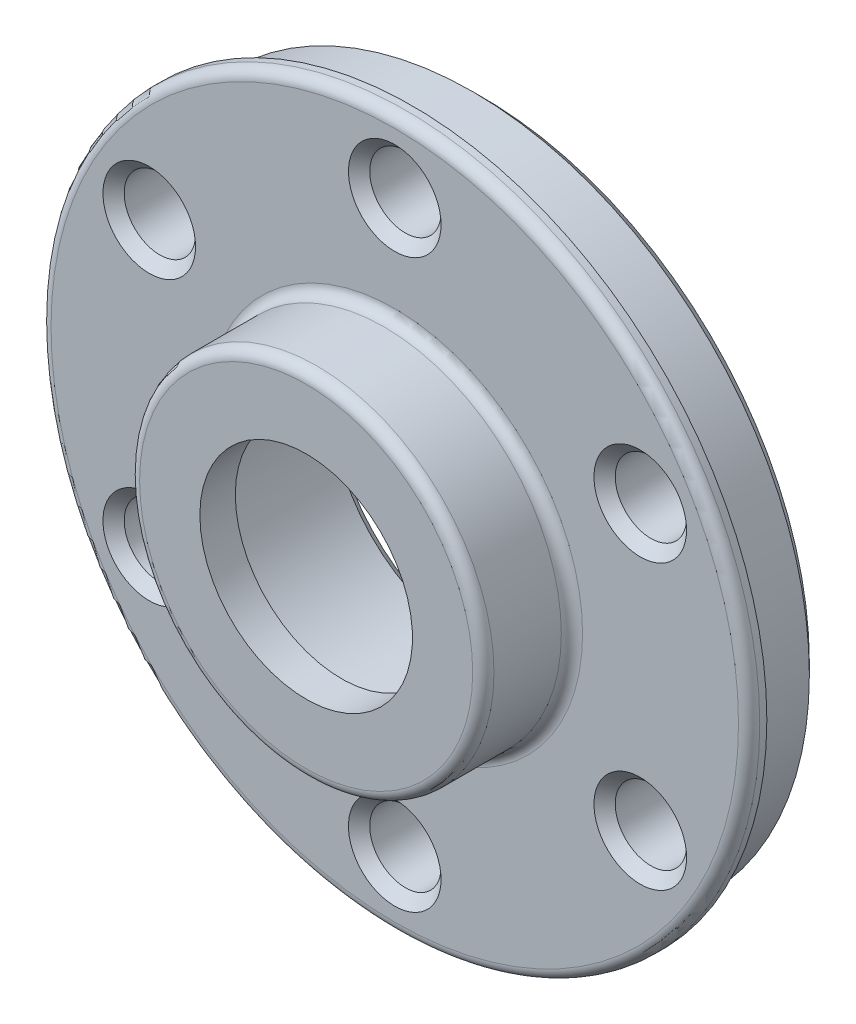
ISO-10303-21;
HEADER;
FILE_DESCRIPTION(('STEP AP214'),'2;1');
FILE_NAME('part.step','',(''),(''),'','','');
FILE_SCHEMA(('AUTOMOTIVE_DESIGN { 1 0 10303 214 1 1 1 1 }'));
ENDSEC;
DATA;
#1=APPLICATION_CONTEXT('core data for automotive mechanical design processes');
#2=APPLICATION_PROTOCOL_DEFINITION('international standard','automotive_design',2000,#1);
#3=PRODUCT_CONTEXT('',#1,'mechanical');
#4=PRODUCT('Part','Part','',(#3));
#5=PRODUCT_RELATED_PRODUCT_CATEGORY('part','',(#4));
#6=PRODUCT_DEFINITION_FORMATION('','',#4);
#7=PRODUCT_DEFINITION_CONTEXT('part definition',#1,'design');
#8=PRODUCT_DEFINITION('design','',#6,#7);
#9=PRODUCT_DEFINITION_SHAPE('','',#8);
#10=(LENGTH_UNIT() NAMED_UNIT(*) SI_UNIT(.MILLI.,.METRE.));
#11=(NAMED_UNIT(*) PLANE_ANGLE_UNIT() SI_UNIT($,.RADIAN.));
#12=(NAMED_UNIT(*) SI_UNIT($,.STERADIAN.) SOLID_ANGLE_UNIT());
#13=UNCERTAINTY_MEASURE_WITH_UNIT(LENGTH_MEASURE(1.E-05),#10,'distance_accuracy_value','');
#14=(GEOMETRIC_REPRESENTATION_CONTEXT(3) GLOBAL_UNCERTAINTY_ASSIGNED_CONTEXT((#13)) GLOBAL_UNIT_ASSIGNED_CONTEXT((#10,
#11,#12)) REPRESENTATION_CONTEXT('',''));
#15=CARTESIAN_POINT('',(0.,0.,0.));
#16=DIRECTION('',(0.,0.,1.));
#17=DIRECTION('',(1.,0.,0.));
#18=AXIS2_PLACEMENT_3D('',#15,#16,#17);
#19=CARTESIAN_POINT('',(0.,0.,2.7));
#20=DIRECTION('',(0.,0.,1.));
#21=DIRECTION('',(1.,0.,0.));
#22=AXIS2_PLACEMENT_3D('',#19,#20,#21);
#23=TOROIDAL_SURFACE('',#22,4.7,0.3);
#24=CARTESIAN_POINT('',(0.,0.,3.));
#25=DIRECTION('',(0.,0.,-1.));
#26=DIRECTION('',(1.,0.,0.));
#27=AXIS2_PLACEMENT_3D('',#24,#25,#26);
#28=CIRCLE('',#27,4.7);
#29=CARTESIAN_POINT('',(4.7,0.,3.));
#30=VERTEX_POINT('',#29);
#31=EDGE_CURVE('E97',#30,#30,#28,.F.);
#32=ORIENTED_EDGE('',*,*,#31,.F.);
#33=EDGE_LOOP('',(#32));
#34=FACE_BOUND('',#33,.T.);
#35=CARTESIAN_POINT('',(0.,0.,2.7));
#36=DIRECTION('',(0.,0.,1.));
#37=DIRECTION('',(1.,0.,0.));
#38=AXIS2_PLACEMENT_3D('',#35,#36,#37);
#39=CIRCLE('',#38,5.);
#40=CARTESIAN_POINT('',(5.,0.,2.7));
#41=VERTEX_POINT('',#40);
#42=EDGE_CURVE('E152',#41,#41,#39,.F.);
#43=ORIENTED_EDGE('',*,*,#42,.F.);
#44=EDGE_LOOP('',(#43));
#45=FACE_BOUND('',#44,.T.);
#46=ADVANCED_FACE('F14',(#34,#45),#23,.T.);
#47=CARTESIAN_POINT('',(0.,0.,0.5));
#48=DIRECTION('',(0.,0.,1.));
#49=DIRECTION('',(1.,0.,0.));
#50=AXIS2_PLACEMENT_3D('',#47,#48,#49);
#51=CYLINDRICAL_SURFACE('',#50,5.);
#52=CARTESIAN_POINT('',(0.,0.,0.8));
#53=DIRECTION('',(0.,0.,-1.));
#54=DIRECTION('',(-1.,0.,0.));
#55=AXIS2_PLACEMENT_3D('',#52,#53,#54);
#56=CIRCLE('',#55,5.);
#57=CARTESIAN_POINT('',(-5.,0.,0.8));
#58=VERTEX_POINT('',#57);
#59=EDGE_CURVE('E88',#58,#58,#56,.F.);
#60=ORIENTED_EDGE('',*,*,#59,.T.);
#61=EDGE_LOOP('',(#60));
#62=FACE_BOUND('',#61,.T.);
#63=ORIENTED_EDGE('',*,*,#42,.T.);
#64=EDGE_LOOP('',(#63));
#65=FACE_BOUND('',#64,.T.);
#66=ADVANCED_FACE('F162',(#62,#65),#51,.T.);
#67=CARTESIAN_POINT('',(0.,0.,3.));
#68=DIRECTION('',(0.,0.,1.));
#69=DIRECTION('',(1.,0.,0.));
#70=AXIS2_PLACEMENT_3D('',#67,#68,#69);
#71=PLANE('',#70);
#72=CARTESIAN_POINT('',(0.,0.,3.));
#73=DIRECTION('',(0.,0.,-1.));
#74=DIRECTION('',(-1.,0.,0.));
#75=AXIS2_PLACEMENT_3D('',#72,#73,#74);
#76=CIRCLE('',#75,3.);
#77=CARTESIAN_POINT('',(-3.,0.,3.));
#78=VERTEX_POINT('',#77);
#79=EDGE_CURVE('E19',#78,#78,#76,.T.);
#80=ORIENTED_EDGE('',*,*,#79,.T.);
#81=EDGE_LOOP('',(#80));
#82=FACE_BOUND('',#81,.T.);
#83=ORIENTED_EDGE('',*,*,#31,.T.);
#84=EDGE_LOOP('',(#83));
#85=FACE_BOUND('',#84,.T.);
#86=ADVANCED_FACE('F154',(#82,#85),#71,.T.);
#87=CARTESIAN_POINT('',(0.,0.,0.));
#88=DIRECTION('',(0.,0.,1.));
#89=DIRECTION('',(1.,0.,0.));
#90=AXIS2_PLACEMENT_3D('',#87,#88,#89);
#91=CYLINDRICAL_SURFACE('',#90,10.);
#92=CARTESIAN_POINT('',(0.,0.,0.2));
#93=DIRECTION('',(0.,0.,1.));
#94=DIRECTION('',(1.,0.,0.));
#95=AXIS2_PLACEMENT_3D('',#92,#93,#94);
#96=CIRCLE('',#95,10.);
#97=CARTESIAN_POINT('',(10.,0.,0.2));
#98=VERTEX_POINT('',#97);
#99=EDGE_CURVE('E92',#98,#98,#96,.T.);
#100=ORIENTED_EDGE('',*,*,#99,.F.);
#101=EDGE_LOOP('',(#100));
#102=FACE_BOUND('',#101,.T.);
#103=CARTESIAN_POINT('',(0.,0.,0.));
#104=DIRECTION('',(0.,0.,1.));
#105=DIRECTION('',(1.,0.,0.));
#106=AXIS2_PLACEMENT_3D('',#103,#104,#105);
#107=CIRCLE('',#106,10.);
#108=CARTESIAN_POINT('',(10.,0.,0.));
#109=VERTEX_POINT('',#108);
#110=EDGE_CURVE('E81',#109,#109,#107,.T.);
#111=ORIENTED_EDGE('',*,*,#110,.T.);
#112=EDGE_LOOP('',(#111));
#113=FACE_BOUND('',#112,.T.);
#114=ADVANCED_FACE('F130',(#102,#113),#91,.T.);
#115=CARTESIAN_POINT('',(0.,0.,0.2));
#116=DIRECTION('',(0.,0.,1.));
#117=DIRECTION('',(1.,0.,0.));
#118=AXIS2_PLACEMENT_3D('',#115,#116,#117);
#119=TOROIDAL_SURFACE('',#118,9.7,0.3);
#120=CARTESIAN_POINT('',(0.,0.,0.5));
#121=DIRECTION('',(0.,0.,-1.));
#122=DIRECTION('',(1.,0.,0.));
#123=AXIS2_PLACEMENT_3D('',#120,#121,#122);
#124=CIRCLE('',#123,9.7);
#125=CARTESIAN_POINT('',(9.7,0.,0.5));
#126=VERTEX_POINT('',#125);
#127=EDGE_CURVE('E83',#126,#126,#124,.F.);
#128=ORIENTED_EDGE('',*,*,#127,.F.);
#129=EDGE_LOOP('',(#128));
#130=FACE_BOUND('',#129,.T.);
#131=ORIENTED_EDGE('',*,*,#99,.T.);
#132=EDGE_LOOP('',(#131));
#133=FACE_BOUND('',#132,.T.);
#134=ADVANCED_FACE('F125',(#130,#133),#119,.T.);
#135=CARTESIAN_POINT('',(0.,0.,0.8));
#136=DIRECTION('',(0.,0.,-1.));
#137=DIRECTION('',(-1.,0.,0.));
#138=AXIS2_PLACEMENT_3D('',#135,#136,#137);
#139=TOROIDAL_SURFACE('',#138,5.3,0.3);
#140=CARTESIAN_POINT('',(0.,0.,0.5));
#141=DIRECTION('',(0.,0.,1.));
#142=DIRECTION('',(1.,0.,0.));
#143=AXIS2_PLACEMENT_3D('',#140,#141,#142);
#144=CIRCLE('',#143,5.3);
#145=CARTESIAN_POINT('',(5.3,0.,0.5));
#146=VERTEX_POINT('',#145);
#147=EDGE_CURVE('E80',#146,#146,#144,.F.);
#148=ORIENTED_EDGE('',*,*,#147,.F.);
#149=EDGE_LOOP('',(#148));
#150=FACE_BOUND('',#149,.T.);
#151=ORIENTED_EDGE('',*,*,#59,.F.);
#152=EDGE_LOOP('',(#151));
#153=FACE_BOUND('',#152,.T.);
#154=ADVANCED_FACE('F114',(#150,#153),#139,.F.);
#155=CARTESIAN_POINT('',(0.,0.,3.));
#156=DIRECTION('',(0.,0.,-1.));
#157=DIRECTION('',(-1.,0.,0.));
#158=AXIS2_PLACEMENT_3D('',#155,#156,#157);
#159=CYLINDRICAL_SURFACE('',#158,3.);
#160=ORIENTED_EDGE('',*,*,#79,.F.);
#161=EDGE_LOOP('',(#160));
#162=FACE_BOUND('',#161,.T.);
#163=CARTESIAN_POINT('',(0.,0.,2.));
#164=DIRECTION('',(0.,0.,-1.));
#165=DIRECTION('',(-1.,0.,0.));
#166=AXIS2_PLACEMENT_3D('',#163,#164,#165);
#167=CIRCLE('',#166,3.);
#168=CARTESIAN_POINT('',(-3.,0.,2.));
#169=VERTEX_POINT('',#168);
#170=EDGE_CURVE('E78',#169,#169,#167,.T.);
#171=ORIENTED_EDGE('',*,*,#170,.T.);
#172=EDGE_LOOP('',(#171));
#173=FACE_BOUND('',#172,.T.);
#174=ADVANCED_FACE('F124',(#162,#173),#159,.F.);
#175=CARTESIAN_POINT('',(0.,0.,0.));
#176=DIRECTION('',(0.,0.,1.));
#177=DIRECTION('',(1.,0.,0.));
#178=AXIS2_PLACEMENT_3D('',#175,#176,#177);
#179=PLANE('',#178);
#180=CARTESIAN_POINT('',(0.,0.,0.));
#181=DIRECTION('',(0.,0.,-1.));
#182=DIRECTION('',(-1.,0.,0.));
#183=AXIS2_PLACEMENT_3D('',#180,#181,#182);
#184=CIRCLE('',#183,9.5);
#185=CARTESIAN_POINT('',(-9.5,0.,0.));
#186=VERTEX_POINT('',#185);
#187=EDGE_CURVE('E75',#186,#186,#184,.T.);
#188=ORIENTED_EDGE('',*,*,#187,.F.);
#189=EDGE_LOOP('',(#188));
#190=FACE_BOUND('',#189,.T.);
#191=ORIENTED_EDGE('',*,*,#110,.F.);
#192=EDGE_LOOP('',(#191));
#193=FACE_BOUND('',#192,.T.);
#194=ADVANCED_FACE('F248',(#190,#193),#179,.F.);
#195=CARTESIAN_POINT('',(0.,0.,0.5));
#196=DIRECTION('',(0.,0.,1.));
#197=DIRECTION('',(1.,0.,0.));
#198=AXIS2_PLACEMENT_3D('',#195,#196,#197);
#199=PLANE('',#198);
#200=CARTESIAN_POINT('',(0.,8.,0.500000000101863));
#201=DIRECTION('',(0.,0.,1.));
#202=DIRECTION('',(1.,0.,0.));
#203=AXIS2_PLACEMENT_3D('',#200,#201,#202);
#204=CIRCLE('',#203,1.30649999982779);
#205=CARTESIAN_POINT('',(1.30649999982779,8.,0.500000000101863));
#206=VERTEX_POINT('',#205);
#207=EDGE_CURVE('E66',#206,#206,#204,.F.);
#208=ORIENTED_EDGE('',*,*,#207,.T.);
#209=EDGE_LOOP('',(#208));
#210=FACE_BOUND('',#209,.T.);
#211=CARTESIAN_POINT('',(6.92820323027551,-4.,0.500000000101863));
#212=DIRECTION('',(0.,0.,1.));
#213=DIRECTION('',(1.,0.,0.));
#214=AXIS2_PLACEMENT_3D('',#211,#212,#213);
#215=CIRCLE('',#214,1.30649999985796);
#216=CARTESIAN_POINT('',(8.23470323013346,-4.,0.500000000101863));
#217=VERTEX_POINT('',#216);
#218=EDGE_CURVE('E69',#217,#217,#215,.F.);
#219=ORIENTED_EDGE('',*,*,#218,.T.);
#220=EDGE_LOOP('',(#219));
#221=FACE_BOUND('',#220,.T.);
#222=CARTESIAN_POINT('',(-6.92820323027551,-4.,0.500000000101863));
#223=DIRECTION('',(0.,0.,1.));
#224=DIRECTION('',(1.,0.,0.));
#225=AXIS2_PLACEMENT_3D('',#222,#223,#224);
#226=CIRCLE('',#225,1.30649999985447);
#227=CARTESIAN_POINT('',(-5.62170323042104,-4.,0.500000000101863));
#228=VERTEX_POINT('',#227);
#229=EDGE_CURVE('E72',#228,#228,#226,.F.);
#230=ORIENTED_EDGE('',*,*,#229,.T.);
#231=EDGE_LOOP('',(#230));
#232=FACE_BOUND('',#231,.T.);
#233=CARTESIAN_POINT('',(-6.92820323027551,4.,0.500000000158707));
#234=DIRECTION('',(0.,0.,1.));
#235=DIRECTION('',(1.,0.,0.));
#236=AXIS2_PLACEMENT_3D('',#233,#234,#235);
#237=CIRCLE('',#236,1.30649999991132);
#238=CARTESIAN_POINT('',(-5.62170323036419,4.,0.500000000158707));
#239=VERTEX_POINT('',#238);
#240=EDGE_CURVE('E57',#239,#239,#237,.F.);
#241=ORIENTED_EDGE('',*,*,#240,.T.);
#242=EDGE_LOOP('',(#241));
#243=FACE_BOUND('',#242,.T.);
#244=CARTESIAN_POINT('',(0.,-8.,0.500000000101863));
#245=DIRECTION('',(0.,0.,1.));
#246=DIRECTION('',(1.,0.,0.));
#247=AXIS2_PLACEMENT_3D('',#244,#245,#246);
#248=CIRCLE('',#247,1.30649999982779);
#249=CARTESIAN_POINT('',(1.30649999982779,-8.,0.500000000101863));
#250=VERTEX_POINT('',#249);
#251=EDGE_CURVE('E60',#250,#250,#248,.F.);
#252=ORIENTED_EDGE('',*,*,#251,.T.);
#253=EDGE_LOOP('',(#252));
#254=FACE_BOUND('',#253,.T.);
#255=CARTESIAN_POINT('',(6.92820323027551,3.99999999999999,0.500000000101863));
#256=DIRECTION('',(0.,0.,1.));
#257=DIRECTION('',(1.,0.,0.));
#258=AXIS2_PLACEMENT_3D('',#255,#256,#257);
#259=CIRCLE('',#258,1.30649999985796);
#260=CARTESIAN_POINT('',(8.23470323013347,3.99999999999999,0.500000000101863));
#261=VERTEX_POINT('',#260);
#262=EDGE_CURVE('E63',#261,#261,#259,.F.);
#263=ORIENTED_EDGE('',*,*,#262,.T.);
#264=EDGE_LOOP('',(#263));
#265=FACE_BOUND('',#264,.T.);
#266=ORIENTED_EDGE('',*,*,#147,.T.);
#267=EDGE_LOOP('',(#266));
#268=FACE_BOUND('',#267,.T.);
#269=ORIENTED_EDGE('',*,*,#127,.T.);
#270=EDGE_LOOP('',(#269));
#271=FACE_BOUND('',#270,.T.);
#272=ADVANCED_FACE('F244',(#210,#221,#232,#243,#254,#265,#268,#271),#199,.T.);
#273=CARTESIAN_POINT('',(0.,0.,2.));
#274=DIRECTION('',(0.,0.,1.));
#275=DIRECTION('',(1.,0.,0.));
#276=AXIS2_PLACEMENT_3D('',#273,#274,#275);
#277=PLANE('',#276);
#278=ORIENTED_EDGE('',*,*,#170,.F.);
#279=EDGE_LOOP('',(#278));
#280=FACE_BOUND('',#279,.T.);
#281=CARTESIAN_POINT('',(0.,0.,2.));
#282=DIRECTION('',(0.,0.,-1.));
#283=DIRECTION('',(-1.,0.,0.));
#284=AXIS2_PLACEMENT_3D('',#281,#282,#283);
#285=CIRCLE('',#284,4.);
#286=CARTESIAN_POINT('',(-4.,0.,2.));
#287=VERTEX_POINT('',#286);
#288=EDGE_CURVE('E53',#287,#287,#285,.T.);
#289=ORIENTED_EDGE('',*,*,#288,.T.);
#290=EDGE_LOOP('',(#289));
#291=FACE_BOUND('',#290,.T.);
#292=ADVANCED_FACE('F240',(#280,#291),#277,.F.);
#293=CARTESIAN_POINT('',(0.,0.,0.));
#294=DIRECTION('',(0.,0.,-1.));
#295=DIRECTION('',(-1.,0.,0.));
#296=AXIS2_PLACEMENT_3D('',#293,#294,#295);
#297=CYLINDRICAL_SURFACE('',#296,9.5);
#298=CARTESIAN_POINT('',(0.,0.,-1.69999999986538));
#299=DIRECTION('',(0.,0.,1.));
#300=DIRECTION('',(-1.,0.,0.));
#301=AXIS2_PLACEMENT_3D('',#298,#299,#300);
#302=CIRCLE('',#301,9.49999999986538);
#303=CARTESIAN_POINT('',(-9.49999999986538,0.,-1.69999999986538));
#304=VERTEX_POINT('',#303);
#305=EDGE_CURVE('E56',#304,#304,#302,.F.);
#306=ORIENTED_EDGE('',*,*,#305,.F.);
#307=EDGE_LOOP('',(#306));
#308=FACE_BOUND('',#307,.T.);
#309=ORIENTED_EDGE('',*,*,#187,.T.);
#310=EDGE_LOOP('',(#309));
#311=FACE_BOUND('',#310,.T.);
#312=ADVANCED_FACE('F236',(#308,#311),#297,.T.);
#313=CARTESIAN_POINT('',(-6.92820323027551,-4.,0.500000000101863));
#314=DIRECTION('',(0.,0.,1.));
#315=DIRECTION('',(1.,0.,0.));
#316=AXIS2_PLACEMENT_3D('',#313,#314,#315);
#317=CONICAL_SURFACE('',#316,1.30649999985447,0.785398162450058);
#318=ORIENTED_EDGE('',*,*,#229,.F.);
#319=EDGE_LOOP('',(#318));
#320=FACE_BOUND('',#319,.T.);
#321=CARTESIAN_POINT('',(-6.92820323027551,-4.,0.199999999999999));
#322=DIRECTION('',(0.,0.,1.));
#323=DIRECTION('',(1.,0.,0.));
#324=AXIS2_PLACEMENT_3D('',#321,#322,#323);
#325=CIRCLE('',#324,1.0065);
#326=CARTESIAN_POINT('',(-5.92170323027551,-4.,0.199999999999999));
#327=VERTEX_POINT('',#326);
#328=EDGE_CURVE('E270',#327,#327,#325,.F.);
#329=ORIENTED_EDGE('',*,*,#328,.T.);
#330=EDGE_LOOP('',(#329));
#331=FACE_BOUND('',#330,.T.);
#332=ADVANCED_FACE('F232',(#320,#331),#317,.F.);
#333=CARTESIAN_POINT('',(6.92820323027551,-4.,0.500000000101863));
#334=DIRECTION('',(0.,0.,1.));
#335=DIRECTION('',(1.,0.,0.));
#336=AXIS2_PLACEMENT_3D('',#333,#334,#335);
#337=CONICAL_SURFACE('',#336,1.30649999985796,0.785398162450058);
#338=ORIENTED_EDGE('',*,*,#218,.F.);
#339=EDGE_LOOP('',(#338));
#340=FACE_BOUND('',#339,.T.);
#341=CARTESIAN_POINT('',(6.92820323027551,-4.,0.199999999999999));
#342=DIRECTION('',(0.,0.,1.));
#343=DIRECTION('',(1.,0.,0.));
#344=AXIS2_PLACEMENT_3D('',#341,#342,#343);
#345=CIRCLE('',#344,1.0065);
#346=CARTESIAN_POINT('',(7.93470323027551,-4.,0.199999999999999));
#347=VERTEX_POINT('',#346);
#348=EDGE_CURVE('E275',#347,#347,#345,.F.);
#349=ORIENTED_EDGE('',*,*,#348,.T.);
#350=EDGE_LOOP('',(#349));
#351=FACE_BOUND('',#350,.T.);
#352=ADVANCED_FACE('F228',(#340,#351),#337,.F.);
#353=CARTESIAN_POINT('',(0.,8.,0.500000000101863));
#354=DIRECTION('',(0.,0.,1.));
#355=DIRECTION('',(1.,0.,0.));
#356=AXIS2_PLACEMENT_3D('',#353,#354,#355);
#357=CONICAL_SURFACE('',#356,1.30649999982779,0.785398162544797);
#358=ORIENTED_EDGE('',*,*,#207,.F.);
#359=EDGE_LOOP('',(#358));
#360=FACE_BOUND('',#359,.T.);
#361=CARTESIAN_POINT('',(0.,8.,0.199999999999999));
#362=DIRECTION('',(0.,0.,1.));
#363=DIRECTION('',(1.,0.,0.));
#364=AXIS2_PLACEMENT_3D('',#361,#362,#363);
#365=CIRCLE('',#364,1.0065);
#366=CARTESIAN_POINT('',(1.0065,8.,0.199999999999999));
#367=VERTEX_POINT('',#366);
#368=EDGE_CURVE('E280',#367,#367,#365,.F.);
#369=ORIENTED_EDGE('',*,*,#368,.T.);
#370=EDGE_LOOP('',(#369));
#371=FACE_BOUND('',#370,.T.);
#372=ADVANCED_FACE('F224',(#360,#371),#357,.F.);
#373=CARTESIAN_POINT('',(6.92820323027551,3.99999999999999,0.500000000101863));
#374=DIRECTION('',(0.,0.,1.));
#375=DIRECTION('',(1.,0.,0.));
#376=AXIS2_PLACEMENT_3D('',#373,#374,#375);
#377=CONICAL_SURFACE('',#376,1.30649999985796,0.785398162450058);
#378=ORIENTED_EDGE('',*,*,#262,.F.);
#379=EDGE_LOOP('',(#378));
#380=FACE_BOUND('',#379,.T.);
#381=CARTESIAN_POINT('',(6.92820323027551,3.99999999999999,0.199999999999999));
#382=DIRECTION('',(0.,0.,1.));
#383=DIRECTION('',(1.,0.,0.));
#384=AXIS2_PLACEMENT_3D('',#381,#382,#383);
#385=CIRCLE('',#384,1.0065);
#386=CARTESIAN_POINT('',(7.93470323027551,3.99999999999999,0.199999999999999));
#387=VERTEX_POINT('',#386);
#388=EDGE_CURVE('E285',#387,#387,#385,.F.);
#389=ORIENTED_EDGE('',*,*,#388,.T.);
#390=EDGE_LOOP('',(#389));
#391=FACE_BOUND('',#390,.T.);
#392=ADVANCED_FACE('F220',(#380,#391),#377,.F.);
#393=CARTESIAN_POINT('',(0.,-8.,0.500000000101863));
#394=DIRECTION('',(0.,0.,1.));
#395=DIRECTION('',(1.,0.,0.));
#396=AXIS2_PLACEMENT_3D('',#393,#394,#395);
#397=CONICAL_SURFACE('',#396,1.30649999982779,0.785398162544797);
#398=ORIENTED_EDGE('',*,*,#251,.F.);
#399=EDGE_LOOP('',(#398));
#400=FACE_BOUND('',#399,.T.);
#401=CARTESIAN_POINT('',(0.,-8.,0.199999999999999));
#402=DIRECTION('',(0.,0.,1.));
#403=DIRECTION('',(1.,0.,0.));
#404=AXIS2_PLACEMENT_3D('',#401,#402,#403);
#405=CIRCLE('',#404,1.0065);
#406=CARTESIAN_POINT('',(1.0065,-8.,0.199999999999999));
#407=VERTEX_POINT('',#406);
#408=EDGE_CURVE('E290',#407,#407,#405,.F.);
#409=ORIENTED_EDGE('',*,*,#408,.T.);
#410=EDGE_LOOP('',(#409));
#411=FACE_BOUND('',#410,.T.);
#412=ADVANCED_FACE('F216',(#400,#411),#397,.F.);
#413=CARTESIAN_POINT('',(-6.92820323027551,4.,0.500000000158707));
#414=DIRECTION('',(0.,0.,1.));
#415=DIRECTION('',(1.,0.,0.));
#416=AXIS2_PLACEMENT_3D('',#413,#414,#415);
#417=CONICAL_SURFACE('',#416,1.30649999991132,0.785398162450058);
#418=ORIENTED_EDGE('',*,*,#240,.F.);
#419=EDGE_LOOP('',(#418));
#420=FACE_BOUND('',#419,.T.);
#421=CARTESIAN_POINT('',(-6.92820323027551,4.,0.199999999999999));
#422=DIRECTION('',(0.,0.,1.));
#423=DIRECTION('',(1.,0.,0.));
#424=AXIS2_PLACEMENT_3D('',#421,#422,#423);
#425=CIRCLE('',#424,1.0065);
#426=CARTESIAN_POINT('',(-5.92170323027551,4.,0.199999999999999));
#427=VERTEX_POINT('',#426);
#428=EDGE_CURVE('E295',#427,#427,#425,.F.);
#429=ORIENTED_EDGE('',*,*,#428,.T.);
#430=EDGE_LOOP('',(#429));
#431=FACE_BOUND('',#430,.T.);
#432=ADVANCED_FACE('F212',(#420,#431),#417,.F.);
#433=CARTESIAN_POINT('',(0.,0.,0.));
#434=DIRECTION('',(0.,0.,-1.));
#435=DIRECTION('',(-1.,0.,0.));
#436=AXIS2_PLACEMENT_3D('',#433,#434,#435);
#437=CYLINDRICAL_SURFACE('',#436,4.);
#438=CARTESIAN_POINT('',(0.,0.,-1.69999999985748));
#439=DIRECTION('',(0.,0.,-1.));
#440=DIRECTION('',(-1.,0.,0.));
#441=AXIS2_PLACEMENT_3D('',#438,#439,#440);
#442=CIRCLE('',#441,4.00000000007594);
#443=CARTESIAN_POINT('',(-4.00000000007594,0.,-1.69999999985748));
#444=VERTEX_POINT('',#443);
#445=EDGE_CURVE('E52',#444,#444,#442,.T.);
#446=ORIENTED_EDGE('',*,*,#445,.T.);
#447=EDGE_LOOP('',(#446));
#448=FACE_BOUND('',#447,.T.);
#449=ORIENTED_EDGE('',*,*,#288,.F.);
#450=EDGE_LOOP('',(#449));
#451=FACE_BOUND('',#450,.T.);
#452=ADVANCED_FACE('F208',(#448,#451),#437,.F.);
#453=CARTESIAN_POINT('',(0.,0.,-1.69999999986538));
#454=DIRECTION('',(0.,0.,1.));
#455=DIRECTION('',(1.,0.,0.));
#456=AXIS2_PLACEMENT_3D('',#453,#454,#455);
#457=CONICAL_SURFACE('',#456,9.49999999986538,0.7853981625);
#458=CARTESIAN_POINT('',(0.,0.,-2.00000000013462));
#459=DIRECTION('',(0.,0.,1.));
#460=DIRECTION('',(1.,0.,0.));
#461=AXIS2_PLACEMENT_3D('',#458,#459,#460);
#462=CIRCLE('',#461,9.20000000013462);
#463=CARTESIAN_POINT('',(9.20000000013462,0.,-2.00000000013462));
#464=VERTEX_POINT('',#463);
#465=EDGE_CURVE('E49',#464,#464,#462,.T.);
#466=ORIENTED_EDGE('',*,*,#465,.T.);
#467=EDGE_LOOP('',(#466));
#468=FACE_BOUND('',#467,.T.);
#469=ORIENTED_EDGE('',*,*,#305,.T.);
#470=EDGE_LOOP('',(#469));
#471=FACE_BOUND('',#470,.T.);
#472=ADVANCED_FACE('F204',(#468,#471),#457,.T.);
#473=CARTESIAN_POINT('',(-6.92820323027551,-4.,-27.8945417290014));
#474=DIRECTION('',(0.,0.,1.));
#475=DIRECTION('',(1.,0.,0.));
#476=AXIS2_PLACEMENT_3D('',#473,#474,#475);
#477=CYLINDRICAL_SURFACE('',#476,1.0065);
#478=ORIENTED_EDGE('',*,*,#328,.F.);
#479=EDGE_LOOP('',(#478));
#480=FACE_BOUND('',#479,.T.);
#481=CARTESIAN_POINT('',(-6.92820323027551,-4.,-2.));
#482=DIRECTION('',(0.,0.,1.));
#483=DIRECTION('',(1.,0.,0.));
#484=AXIS2_PLACEMENT_3D('',#481,#482,#483);
#485=CIRCLE('',#484,1.0065);
#486=CARTESIAN_POINT('',(-5.92170323027551,-4.,-2.));
#487=VERTEX_POINT('',#486);
#488=EDGE_CURVE('E46',#487,#487,#485,.F.);
#489=ORIENTED_EDGE('',*,*,#488,.T.);
#490=EDGE_LOOP('',(#489));
#491=FACE_BOUND('',#490,.T.);
#492=ADVANCED_FACE('F200',(#480,#491),#477,.F.);
#493=CARTESIAN_POINT('',(6.92820323027551,-4.,-27.8945417290014));
#494=DIRECTION('',(0.,0.,1.));
#495=DIRECTION('',(1.,0.,0.));
#496=AXIS2_PLACEMENT_3D('',#493,#494,#495);
#497=CYLINDRICAL_SURFACE('',#496,1.0065);
#498=ORIENTED_EDGE('',*,*,#348,.F.);
#499=EDGE_LOOP('',(#498));
#500=FACE_BOUND('',#499,.T.);
#501=CARTESIAN_POINT('',(6.92820323027551,-4.,-2.));
#502=DIRECTION('',(0.,0.,1.));
#503=DIRECTION('',(1.,0.,0.));
#504=AXIS2_PLACEMENT_3D('',#501,#502,#503);
#505=CIRCLE('',#504,1.0065);
#506=CARTESIAN_POINT('',(7.93470323027551,-4.,-2.));
#507=VERTEX_POINT('',#506);
#508=EDGE_CURVE('E43',#507,#507,#505,.F.);
#509=ORIENTED_EDGE('',*,*,#508,.T.);
#510=EDGE_LOOP('',(#509));
#511=FACE_BOUND('',#510,.T.);
#512=ADVANCED_FACE('F196',(#500,#511),#497,.F.);
#513=CARTESIAN_POINT('',(0.,8.,-27.8945417290014));
#514=DIRECTION('',(0.,0.,1.));
#515=DIRECTION('',(1.,0.,0.));
#516=AXIS2_PLACEMENT_3D('',#513,#514,#515);
#517=CYLINDRICAL_SURFACE('',#516,1.0065);
#518=ORIENTED_EDGE('',*,*,#368,.F.);
#519=EDGE_LOOP('',(#518));
#520=FACE_BOUND('',#519,.T.);
#521=CARTESIAN_POINT('',(0.,8.,-2.));
#522=DIRECTION('',(0.,0.,1.));
#523=DIRECTION('',(1.,0.,0.));
#524=AXIS2_PLACEMENT_3D('',#521,#522,#523);
#525=CIRCLE('',#524,1.0065);
#526=CARTESIAN_POINT('',(1.0065,8.,-2.));
#527=VERTEX_POINT('',#526);
#528=EDGE_CURVE('E40',#527,#527,#525,.F.);
#529=ORIENTED_EDGE('',*,*,#528,.T.);
#530=EDGE_LOOP('',(#529));
#531=FACE_BOUND('',#530,.T.);
#532=ADVANCED_FACE('F192',(#520,#531),#517,.F.);
#533=CARTESIAN_POINT('',(6.92820323027551,3.99999999999999,-27.8945417290014));
#534=DIRECTION('',(0.,0.,1.));
#535=DIRECTION('',(1.,0.,0.));
#536=AXIS2_PLACEMENT_3D('',#533,#534,#535);
#537=CYLINDRICAL_SURFACE('',#536,1.0065);
#538=ORIENTED_EDGE('',*,*,#388,.F.);
#539=EDGE_LOOP('',(#538));
#540=FACE_BOUND('',#539,.T.);
#541=CARTESIAN_POINT('',(6.92820323027551,3.99999999999999,-2.));
#542=DIRECTION('',(0.,0.,1.));
#543=DIRECTION('',(1.,0.,0.));
#544=AXIS2_PLACEMENT_3D('',#541,#542,#543);
#545=CIRCLE('',#544,1.0065);
#546=CARTESIAN_POINT('',(7.93470323027551,3.99999999999999,-2.));
#547=VERTEX_POINT('',#546);
#548=EDGE_CURVE('E37',#547,#547,#545,.F.);
#549=ORIENTED_EDGE('',*,*,#548,.T.);
#550=EDGE_LOOP('',(#549));
#551=FACE_BOUND('',#550,.T.);
#552=ADVANCED_FACE('F188',(#540,#551),#537,.F.);
#553=CARTESIAN_POINT('',(0.,-8.,-27.8945417290014));
#554=DIRECTION('',(0.,0.,1.));
#555=DIRECTION('',(1.,0.,0.));
#556=AXIS2_PLACEMENT_3D('',#553,#554,#555);
#557=CYLINDRICAL_SURFACE('',#556,1.0065);
#558=ORIENTED_EDGE('',*,*,#408,.F.);
#559=EDGE_LOOP('',(#558));
#560=FACE_BOUND('',#559,.T.);
#561=CARTESIAN_POINT('',(0.,-8.,-2.));
#562=DIRECTION('',(0.,0.,1.));
#563=DIRECTION('',(1.,0.,0.));
#564=AXIS2_PLACEMENT_3D('',#561,#562,#563);
#565=CIRCLE('',#564,1.0065);
#566=CARTESIAN_POINT('',(1.0065,-8.,-2.));
#567=VERTEX_POINT('',#566);
#568=EDGE_CURVE('E28',#567,#567,#565,.F.);
#569=ORIENTED_EDGE('',*,*,#568,.T.);
#570=EDGE_LOOP('',(#569));
#571=FACE_BOUND('',#570,.T.);
#572=ADVANCED_FACE('F184',(#560,#571),#557,.F.);
#573=CARTESIAN_POINT('',(-6.92820323027551,4.,-27.8945417290014));
#574=DIRECTION('',(0.,0.,1.));
#575=DIRECTION('',(1.,0.,0.));
#576=AXIS2_PLACEMENT_3D('',#573,#574,#575);
#577=CYLINDRICAL_SURFACE('',#576,1.0065);
#578=ORIENTED_EDGE('',*,*,#428,.F.);
#579=EDGE_LOOP('',(#578));
#580=FACE_BOUND('',#579,.T.);
#581=CARTESIAN_POINT('',(-6.92820323027551,4.,-2.));
#582=DIRECTION('',(0.,0.,1.));
#583=DIRECTION('',(1.,0.,0.));
#584=AXIS2_PLACEMENT_3D('',#581,#582,#583);
#585=CIRCLE('',#584,1.0065);
#586=CARTESIAN_POINT('',(-5.92170323027551,4.,-2.));
#587=VERTEX_POINT('',#586);
#588=EDGE_CURVE('E23',#587,#587,#585,.F.);
#589=ORIENTED_EDGE('',*,*,#588,.T.);
#590=EDGE_LOOP('',(#589));
#591=FACE_BOUND('',#590,.T.);
#592=ADVANCED_FACE('F178',(#580,#591),#577,.F.);
#593=CARTESIAN_POINT('',(0.,0.,-2.00000000006639));
#594=DIRECTION('',(0.,0.,-1.));
#595=DIRECTION('',(-1.,0.,0.));
#596=AXIS2_PLACEMENT_3D('',#593,#594,#595);
#597=CONICAL_SURFACE('',#596,4.29999999971642,0.785398162450058);
#598=CARTESIAN_POINT('',(0.,0.,-2.00000000012324));
#599=DIRECTION('',(0.,0.,-1.));
#600=DIRECTION('',(-1.,0.,0.));
#601=AXIS2_PLACEMENT_3D('',#598,#599,#600);
#602=CIRCLE('',#601,4.29999999977326);
#603=CARTESIAN_POINT('',(-4.29999999977326,0.,-2.00000000012324));
#604=VERTEX_POINT('',#603);
#605=EDGE_CURVE('E10',#604,#604,#602,.T.);
#606=ORIENTED_EDGE('',*,*,#605,.T.);
#607=EDGE_LOOP('',(#606));
#608=FACE_BOUND('',#607,.T.);
#609=ORIENTED_EDGE('',*,*,#445,.F.);
#610=EDGE_LOOP('',(#609));
#611=FACE_BOUND('',#610,.T.);
#612=ADVANCED_FACE('F172',(#608,#611),#597,.F.);
#613=CARTESIAN_POINT('',(0.,0.,-2.));
#614=DIRECTION('',(0.,0.,1.));
#615=DIRECTION('',(1.,0.,0.));
#616=AXIS2_PLACEMENT_3D('',#613,#614,#615);
#617=PLANE('',#616);
#618=ORIENTED_EDGE('',*,*,#605,.F.);
#619=EDGE_LOOP('',(#618));
#620=FACE_BOUND('',#619,.T.);
#621=ORIENTED_EDGE('',*,*,#588,.F.);
#622=EDGE_LOOP('',(#621));
#623=FACE_BOUND('',#622,.T.);
#624=ORIENTED_EDGE('',*,*,#568,.F.);
#625=EDGE_LOOP('',(#624));
#626=FACE_BOUND('',#625,.T.);
#627=ORIENTED_EDGE('',*,*,#548,.F.);
#628=EDGE_LOOP('',(#627));
#629=FACE_BOUND('',#628,.T.);
#630=ORIENTED_EDGE('',*,*,#528,.F.);
#631=EDGE_LOOP('',(#630));
#632=FACE_BOUND('',#631,.T.);
#633=ORIENTED_EDGE('',*,*,#508,.F.);
#634=EDGE_LOOP('',(#633));
#635=FACE_BOUND('',#634,.T.);
#636=ORIENTED_EDGE('',*,*,#488,.F.);
#637=EDGE_LOOP('',(#636));
#638=FACE_BOUND('',#637,.T.);
#639=ORIENTED_EDGE('',*,*,#465,.F.);
#640=EDGE_LOOP('',(#639));
#641=FACE_BOUND('',#640,.T.);
#642=ADVANCED_FACE('F170',(#620,#623,#626,#629,#632,#635,#638,#641),#617,.F.);
#643=CLOSED_SHELL('',(#46,#66,#86,#114,#134,#154,#174,#194,#272,#292,#312,#332,#352,#372,#392,
#412,#432,#452,#472,#492,#512,#532,#552,#572,#592,#612,#642));
#644=MANIFOLD_SOLID_BREP('B1',#643);
#645=ADVANCED_BREP_SHAPE_REPRESENTATION('',(#18,#644),#14);
#646=SHAPE_DEFINITION_REPRESENTATION(#9,#645);
ENDSEC;
END-ISO-10303-21;
